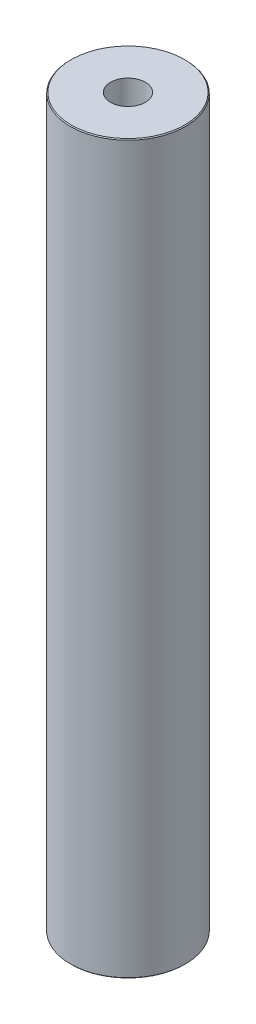
ISO-10303-21;
HEADER;
FILE_DESCRIPTION(('STEP AP214'),'2;1');
FILE_NAME('part.step','',(''),(''),'','','');
FILE_SCHEMA(('AUTOMOTIVE_DESIGN { 1 0 10303 214 1 1 1 1 }'));
ENDSEC;
DATA;
#1=APPLICATION_CONTEXT('core data for automotive mechanical design processes');
#2=APPLICATION_PROTOCOL_DEFINITION('international standard','automotive_design',2000,#1);
#3=PRODUCT_CONTEXT('',#1,'mechanical');
#4=PRODUCT('Part','Part','',(#3));
#5=PRODUCT_RELATED_PRODUCT_CATEGORY('part','',(#4));
#6=PRODUCT_DEFINITION_FORMATION('','',#4);
#7=PRODUCT_DEFINITION_CONTEXT('part definition',#1,'design');
#8=PRODUCT_DEFINITION('design','',#6,#7);
#9=PRODUCT_DEFINITION_SHAPE('','',#8);
#10=(LENGTH_UNIT() NAMED_UNIT(*) SI_UNIT(.MILLI.,.METRE.));
#11=(NAMED_UNIT(*) PLANE_ANGLE_UNIT() SI_UNIT($,.RADIAN.));
#12=(NAMED_UNIT(*) SI_UNIT($,.STERADIAN.) SOLID_ANGLE_UNIT());
#13=UNCERTAINTY_MEASURE_WITH_UNIT(LENGTH_MEASURE(1.E-05),#10,'distance_accuracy_value','');
#14=(GEOMETRIC_REPRESENTATION_CONTEXT(3) GLOBAL_UNCERTAINTY_ASSIGNED_CONTEXT((#13)) GLOBAL_UNIT_ASSIGNED_CONTEXT((#10,
#11,#12)) REPRESENTATION_CONTEXT('',''));
#15=CARTESIAN_POINT('',(0.,0.,0.));
#16=DIRECTION('',(0.,0.,1.));
#17=DIRECTION('',(1.,0.,0.));
#18=AXIS2_PLACEMENT_3D('',#15,#16,#17);
#19=CARTESIAN_POINT('',(0.,600.,0.));
#20=DIRECTION('',(0.,-1.,0.));
#21=DIRECTION('',(0.,0.,-1.));
#22=AXIS2_PLACEMENT_3D('',#19,#20,#21);
#23=CYLINDRICAL_SURFACE('',#22,47.5);
#24=CARTESIAN_POINT('',(0.,599.287111874044,0.));
#25=DIRECTION('',(0.,1.,0.));
#26=DIRECTION('',(0.,0.,1.));
#27=AXIS2_PLACEMENT_3D('',#24,#25,#26);
#28=CIRCLE('',#27,47.5);
#29=CARTESIAN_POINT('',(0.,599.287111874044,47.5));
#30=VERTEX_POINT('',#29);
#31=EDGE_CURVE('E50',#30,#30,#28,.F.);
#32=ORIENTED_EDGE('',*,*,#31,.T.);
#33=EDGE_LOOP('',(#32));
#34=FACE_BOUND('',#33,.T.);
#35=CARTESIAN_POINT('',(0.,0.712888125955824,0.));
#36=DIRECTION('',(0.,1.,0.));
#37=DIRECTION('',(0.,0.,1.));
#38=AXIS2_PLACEMENT_3D('',#35,#36,#37);
#39=CIRCLE('',#38,47.5);
#40=CARTESIAN_POINT('',(0.,0.712888125955824,47.5));
#41=VERTEX_POINT('',#40);
#42=EDGE_CURVE('E51',#41,#41,#39,.T.);
#43=ORIENTED_EDGE('',*,*,#42,.T.);
#44=EDGE_LOOP('',(#43));
#45=FACE_BOUND('',#44,.T.);
#46=ADVANCED_FACE('F39',(#34,#45),#23,.T.);
#47=CARTESIAN_POINT('',(0.,600.,0.));
#48=DIRECTION('',(0.,1.,0.));
#49=DIRECTION('',(0.,0.,1.));
#50=AXIS2_PLACEMENT_3D('',#47,#48,#49);
#51=PLANE('',#50);
#52=CARTESIAN_POINT('',(0.,600.,0.));
#53=DIRECTION('',(0.,1.,0.));
#54=DIRECTION('',(0.,0.,1.));
#55=AXIS2_PLACEMENT_3D('',#52,#53,#54);
#56=CIRCLE('',#55,46.7871118740442);
#57=CARTESIAN_POINT('',(0.,600.,46.7871118740442));
#58=VERTEX_POINT('',#57);
#59=EDGE_CURVE('E54',#58,#58,#56,.T.);
#60=ORIENTED_EDGE('',*,*,#59,.T.);
#61=EDGE_LOOP('',(#60));
#62=FACE_BOUND('',#61,.T.);
#63=CARTESIAN_POINT('',(0.,600.,0.));
#64=DIRECTION('',(0.,1.,0.));
#65=DIRECTION('',(0.,0.,1.));
#66=AXIS2_PLACEMENT_3D('',#63,#64,#65);
#67=CIRCLE('',#66,14.371323884573);
#68=CARTESIAN_POINT('',(0.,600.,14.371323884573));
#69=VERTEX_POINT('',#68);
#70=EDGE_CURVE('E58',#69,#69,#67,.T.);
#71=ORIENTED_EDGE('',*,*,#70,.F.);
#72=EDGE_LOOP('',(#71));
#73=FACE_BOUND('',#72,.T.);
#74=ADVANCED_FACE('F69',(#62,#73),#51,.T.);
#75=CARTESIAN_POINT('',(0.,0.,0.));
#76=DIRECTION('',(0.,1.,0.));
#77=DIRECTION('',(0.,0.,1.));
#78=AXIS2_PLACEMENT_3D('',#75,#76,#77);
#79=PLANE('',#78);
#80=CARTESIAN_POINT('',(0.,0.,0.));
#81=DIRECTION('',(0.,1.,0.));
#82=DIRECTION('',(0.,0.,1.));
#83=AXIS2_PLACEMENT_3D('',#80,#81,#82);
#84=CIRCLE('',#83,46.7871118740442);
#85=CARTESIAN_POINT('',(0.,0.,46.7871118740442));
#86=VERTEX_POINT('',#85);
#87=EDGE_CURVE('E10',#86,#86,#84,.F.);
#88=ORIENTED_EDGE('',*,*,#87,.T.);
#89=EDGE_LOOP('',(#88));
#90=FACE_BOUND('',#89,.T.);
#91=CARTESIAN_POINT('',(0.,0.,0.));
#92=DIRECTION('',(0.,1.,0.));
#93=DIRECTION('',(0.,0.,1.));
#94=AXIS2_PLACEMENT_3D('',#91,#92,#93);
#95=CIRCLE('',#94,14.371323884573);
#96=CARTESIAN_POINT('',(0.,0.,14.371323884573));
#97=VERTEX_POINT('',#96);
#98=EDGE_CURVE('E63',#97,#97,#95,.T.);
#99=ORIENTED_EDGE('',*,*,#98,.T.);
#100=EDGE_LOOP('',(#99));
#101=FACE_BOUND('',#100,.T.);
#102=ADVANCED_FACE('F75',(#90,#101),#79,.F.);
#103=CARTESIAN_POINT('',(0.,600.,0.));
#104=DIRECTION('',(0.,-1.,0.));
#105=DIRECTION('',(0.,0.,-1.));
#106=AXIS2_PLACEMENT_3D('',#103,#104,#105);
#107=CYLINDRICAL_SURFACE('',#106,14.371323884573);
#108=ORIENTED_EDGE('',*,*,#70,.T.);
#109=EDGE_LOOP('',(#108));
#110=FACE_BOUND('',#109,.T.);
#111=ORIENTED_EDGE('',*,*,#98,.F.);
#112=EDGE_LOOP('',(#111));
#113=FACE_BOUND('',#112,.T.);
#114=ADVANCED_FACE('F70',(#110,#113),#107,.F.);
#115=CARTESIAN_POINT('',(0.,600.,0.));
#116=DIRECTION('',(0.,-1.,0.));
#117=DIRECTION('',(0.,0.,-1.));
#118=AXIS2_PLACEMENT_3D('',#115,#116,#117);
#119=CONICAL_SURFACE('',#118,46.7871118740442,0.785398163397507);
#120=ORIENTED_EDGE('',*,*,#31,.F.);
#121=EDGE_LOOP('',(#120));
#122=FACE_BOUND('',#121,.T.);
#123=ORIENTED_EDGE('',*,*,#59,.F.);
#124=EDGE_LOOP('',(#123));
#125=FACE_BOUND('',#124,.T.);
#126=ADVANCED_FACE('F81',(#122,#125),#119,.T.);
#127=CARTESIAN_POINT('',(0.,0.712888125955824,0.));
#128=DIRECTION('',(0.,1.,0.));
#129=DIRECTION('',(0.,0.,1.));
#130=AXIS2_PLACEMENT_3D('',#127,#128,#129);
#131=CONICAL_SURFACE('',#130,47.5,0.785398163397463);
#132=CARTESIAN_POINT('',(0.,0.,46.7871118740442));
#133=CARTESIAN_POINT('',(0.,0.00742591797870449,46.7945377920229));
#134=CARTESIAN_POINT('',(0.,0.0148518359574117,46.8019637100016));
#135=CARTESIAN_POINT('',(0.,0.029703671914826,46.816815545959));
#136=CARTESIAN_POINT('',(0.,0.0371295898935331,46.8242414639377));
#137=CARTESIAN_POINT('',(0.,0.0519814258509458,46.8390932998951));
#138=CARTESIAN_POINT('',(0.,0.0594073438296513,46.8465192178738));
#139=CARTESIAN_POINT('',(0.,0.0742591797870643,46.8613710538312));
#140=CARTESIAN_POINT('',(0.,0.0816850977657717,46.8687969718099));
#141=CARTESIAN_POINT('',(0.,0.0965369337231852,46.8836488077673));
#142=CARTESIAN_POINT('',(0.,0.103962851701891,46.8910747257461));
#143=CARTESIAN_POINT('',(0.,0.118814687659303,46.9059265617035));
#144=CARTESIAN_POINT('',(0.,0.12624060563801,46.9133524796822));
#145=CARTESIAN_POINT('',(0.,0.141092441595423,46.9282043156396));
#146=CARTESIAN_POINT('',(0.,0.148518359574131,46.9356302336183));
#147=CARTESIAN_POINT('',(0.,0.163370195531543,46.9504820695757));
#148=CARTESIAN_POINT('',(0.,0.170796113510249,46.9579079875544));
#149=CARTESIAN_POINT('',(0.,0.185647949467662,46.9727598235118));
#150=CARTESIAN_POINT('',(0.,0.193073867446369,46.9801857414905));
#151=CARTESIAN_POINT('',(0.,0.207925703403783,46.9950375774479));
#152=CARTESIAN_POINT('',(0.,0.215351621382489,47.0024634954267));
#153=CARTESIAN_POINT('',(0.,0.230203457339901,47.0173153313841));
#154=CARTESIAN_POINT('',(0.,0.237629375318607,47.0247412493628));
#155=CARTESIAN_POINT('',(0.,0.252481211276021,47.0395930853202));
#156=CARTESIAN_POINT('',(0.,0.259907129254728,47.0470190032989));
#157=CARTESIAN_POINT('',(0.,0.274758965212141,47.0618708392563));
#158=CARTESIAN_POINT('',(0.,0.282184883190846,47.069296757235));
#159=CARTESIAN_POINT('',(0.,0.297036719148259,47.0841485931924));
#160=CARTESIAN_POINT('',(0.,0.304462637126967,47.0915745111711));
#161=CARTESIAN_POINT('',(0.,0.31931447308438,47.1064263471285));
#162=CARTESIAN_POINT('',(0.,0.326740391063085,47.1138522651073));
#163=CARTESIAN_POINT('',(0.,0.341592227020498,47.1287041010647));
#164=CARTESIAN_POINT('',(0.,0.349018144999206,47.1361300190434));
#165=CARTESIAN_POINT('',(0.,0.363869980956619,47.1509818550008));
#166=CARTESIAN_POINT('',(0.,0.371295898935325,47.1584077729795));
#167=CARTESIAN_POINT('',(0.,0.386147734892738,47.1732596089369));
#168=CARTESIAN_POINT('',(0.,0.393573652871444,47.1806855269156));
#169=CARTESIAN_POINT('',(0.,0.408425488828857,47.195537362873));
#170=CARTESIAN_POINT('',(0.,0.415851406807565,47.2029632808517));
#171=CARTESIAN_POINT('',(0.,0.430703242764977,47.2178151168091));
#172=CARTESIAN_POINT('',(0.,0.438129160743683,47.2252410347879));
#173=CARTESIAN_POINT('',(0.,0.452980996701096,47.2400928707453));
#174=CARTESIAN_POINT('',(0.,0.460406914679803,47.247518788724));
#175=CARTESIAN_POINT('',(0.,0.475258750637217,47.2623706246814));
#176=CARTESIAN_POINT('',(0.,0.482684668615923,47.2697965426601));
#177=CARTESIAN_POINT('',(0.,0.497536504573335,47.2846483786175));
#178=CARTESIAN_POINT('',(0.,0.504962422552041,47.2920742965962));
#179=CARTESIAN_POINT('',(0.,0.519814258509455,47.3069261325536));
#180=CARTESIAN_POINT('',(0.,0.527240176488162,47.3143520505323));
#181=CARTESIAN_POINT('',(0.,0.542092012445575,47.3292038864898));
#182=CARTESIAN_POINT('',(0.,0.549517930424281,47.3366298044685));
#183=CARTESIAN_POINT('',(0.,0.564369766381693,47.3514816404259));
#184=CARTESIAN_POINT('',(0.,0.571795684360401,47.3589075584046));
#185=CARTESIAN_POINT('',(0.,0.586647520317814,47.373759394362));
#186=CARTESIAN_POINT('',(0.,0.59407343829652,47.3811853123407));
#187=CARTESIAN_POINT('',(0.,0.608925274253933,47.3960371482981));
#188=CARTESIAN_POINT('',(0.,0.616351192232639,47.4034630662768));
#189=CARTESIAN_POINT('',(0.,0.631203028190052,47.4183149022342));
#190=CARTESIAN_POINT('',(0.,0.63862894616876,47.4257408202129));
#191=CARTESIAN_POINT('',(0.,0.653480782126173,47.4405926561704));
#192=CARTESIAN_POINT('',(0.,0.660906700104878,47.4480185741491));
#193=CARTESIAN_POINT('',(0.,0.675758536062291,47.4628704101065));
#194=CARTESIAN_POINT('',(0.,0.683184454040998,47.4702963280852));
#195=CARTESIAN_POINT('',(0.,0.698036289998412,47.4851481640426));
#196=CARTESIAN_POINT('',(0.,0.705462207977119,47.4925740820213));
#197=CARTESIAN_POINT('',(0.,0.712888125955824,47.5));
#198=B_SPLINE_CURVE_WITH_KNOTS('',3,(#132,#133,#134,#135,#136,#137,#138,#139,#140,#141,#142,
#143,#144,#145,#146,#147,#148,#149,#150,#151,#152,#153,#154,#155,#156,#157,#158,#159,#160,#161,
#162,#163,#164,#165,#166,#167,#168,#169,#170,#171,#172,#173,#174,#175,#176,#177,#178,#179,#180,
#181,#182,#183,#184,#185,#186,#187,#188,#189,#190,#191,#192,#193,#194,#195,#196,#197),
.UNSPECIFIED.,.F.,.F.,(4,2,2,2,2,2,2,2,2,2,2,2,2,2,2,2,2,2,2,2,2,2,2,2,2,2,2,2,2,2,2,2,4),(0.,
0.0315055017556733,0.0630110035113416,0.0945165052670149,0.126022007022683,0.157527508778356,
0.18903301053403,0.220538512289698,0.252044014045371,0.28354951580104,0.315055017556713,
0.346560519312386,0.378066021068055,0.409571522823728,0.441077024579396,0.472582526335069,
0.504088028090738,0.535593529846411,0.567099031602084,0.598604533357753,0.630110035113426,
0.661615536869094,0.693121038624767,0.724626540380441,0.756132042136109,0.787637543891782,
0.819143045647451,0.850648547403124,0.882154049158797,0.913659550914466,0.945165052670139,
0.976670554425807,1.00817605618148),.UNSPECIFIED.);
#199=EDGE_CURVE('BSEAM45',#86,#41,#198,.T.);
#200=ORIENTED_EDGE('',*,*,#87,.F.);
#201=ORIENTED_EDGE('',*,*,#42,.F.);
#202=ORIENTED_EDGE('',*,*,#199,.T.);
#203=ORIENTED_EDGE('',*,*,#199,.F.);
#204=EDGE_LOOP('',(#200,#202,#201,#203));
#205=FACE_BOUND('',#204,.T.);
#206=ADVANCED_FACE('F45',(#205),#131,.T.);
#207=CLOSED_SHELL('',(#46,#74,#102,#114,#126,#206));
#208=MANIFOLD_SOLID_BREP('B2',#207);
#209=ADVANCED_BREP_SHAPE_REPRESENTATION('',(#18,#208),#14);
#210=SHAPE_DEFINITION_REPRESENTATION(#9,#209);
ENDSEC;
END-ISO-10303-21;
